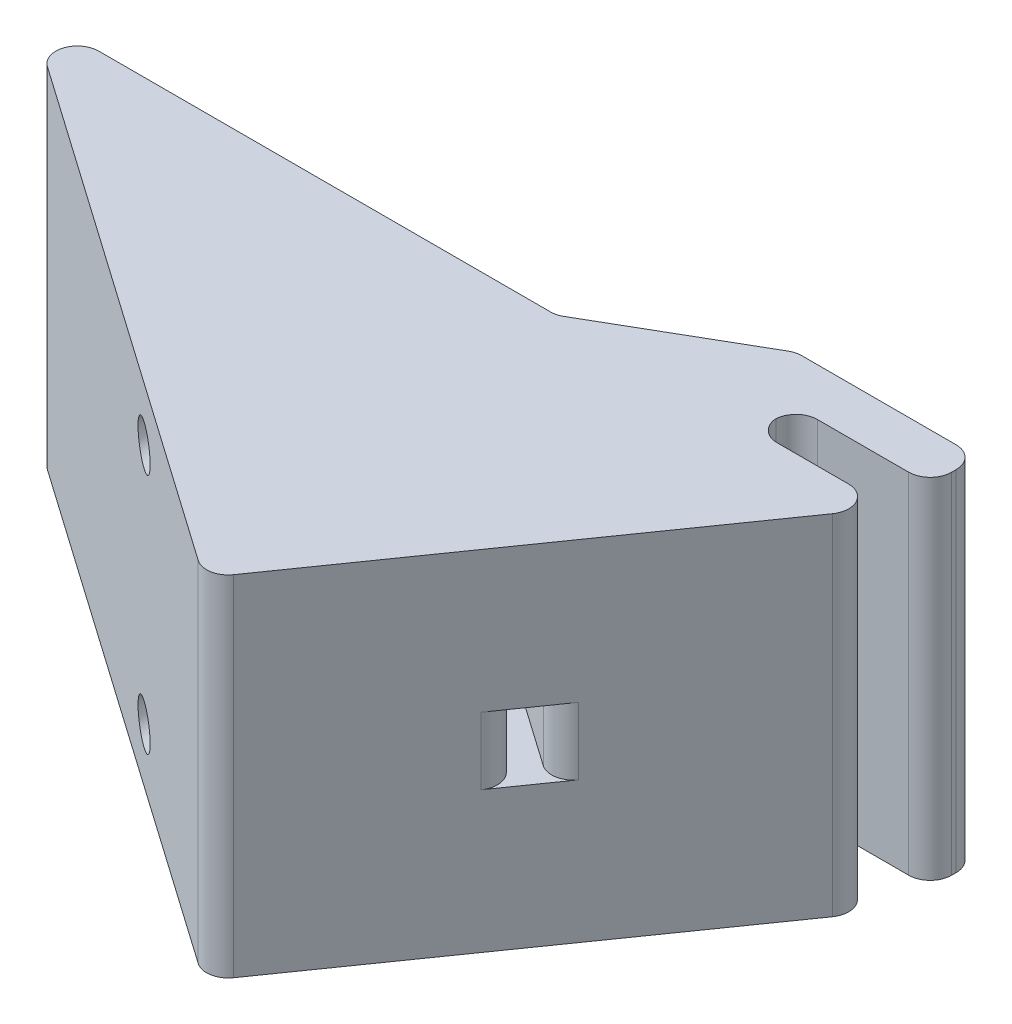
ISO-10303-21;
HEADER;
FILE_DESCRIPTION(('STEP AP214'),'2;1');
FILE_NAME('part.step','',(''),(''),'','','');
FILE_SCHEMA(('AUTOMOTIVE_DESIGN { 1 0 10303 214 1 1 1 1 }'));
ENDSEC;
DATA;
#1=APPLICATION_CONTEXT('core data for automotive mechanical design processes');
#2=APPLICATION_PROTOCOL_DEFINITION('international standard','automotive_design',2000,#1);
#3=PRODUCT_CONTEXT('',#1,'mechanical');
#4=PRODUCT('Part','Part','',(#3));
#5=PRODUCT_RELATED_PRODUCT_CATEGORY('part','',(#4));
#6=PRODUCT_DEFINITION_FORMATION('','',#4);
#7=PRODUCT_DEFINITION_CONTEXT('part definition',#1,'design');
#8=PRODUCT_DEFINITION('design','',#6,#7);
#9=PRODUCT_DEFINITION_SHAPE('','',#8);
#10=(LENGTH_UNIT() NAMED_UNIT(*) SI_UNIT(.MILLI.,.METRE.));
#11=(NAMED_UNIT(*) PLANE_ANGLE_UNIT() SI_UNIT($,.RADIAN.));
#12=(NAMED_UNIT(*) SI_UNIT($,.STERADIAN.) SOLID_ANGLE_UNIT());
#13=UNCERTAINTY_MEASURE_WITH_UNIT(LENGTH_MEASURE(1.E-05),#10,'distance_accuracy_value','');
#14=(GEOMETRIC_REPRESENTATION_CONTEXT(3) GLOBAL_UNCERTAINTY_ASSIGNED_CONTEXT((#13)) GLOBAL_UNIT_ASSIGNED_CONTEXT((#10,
#11,#12)) REPRESENTATION_CONTEXT('',''));
#15=CARTESIAN_POINT('',(0.,0.,0.));
#16=DIRECTION('',(0.,0.,1.));
#17=DIRECTION('',(1.,0.,0.));
#18=AXIS2_PLACEMENT_3D('',#15,#16,#17);
#19=CARTESIAN_POINT('',(0.,20.6375,0.));
#20=DIRECTION('',(0.,0.,1.));
#21=DIRECTION('',(1.,0.,0.));
#22=AXIS2_PLACEMENT_3D('',#19,#20,#21);
#23=PLANE('',#22);
#24=DIRECTION('',(-1.,0.,0.));
#25=VECTOR('',#24,1.);
#26=CARTESIAN_POINT('',(0.,20.6375,0.));
#27=LINE('',#26,#25);
#28=CARTESIAN_POINT('',(-4.87929460250673,20.6375,0.));
#29=VERTEX_POINT('',#28);
#30=CARTESIAN_POINT('',(-13.335,20.6375,0.));
#31=VERTEX_POINT('',#30);
#32=EDGE_CURVE('E404',#29,#31,#27,.T.);
#33=ORIENTED_EDGE('',*,*,#32,.F.);
#34=DIRECTION('',(0.,-1.,0.));
#35=VECTOR('',#34,1.);
#36=CARTESIAN_POINT('',(-4.87929460250673,20.6375,0.));
#37=LINE('',#36,#35);
#38=CARTESIAN_POINT('',(-4.87929460250673,-20.6375,0.));
#39=VERTEX_POINT('',#38);
#40=EDGE_CURVE('E295',#29,#39,#37,.T.);
#41=ORIENTED_EDGE('',*,*,#40,.T.);
#42=DIRECTION('',(-1.,0.,0.));
#43=VECTOR('',#42,1.);
#44=CARTESIAN_POINT('',(0.,-20.6375,0.));
#45=LINE('',#44,#43);
#46=CARTESIAN_POINT('',(-13.335,-20.6375,0.));
#47=VERTEX_POINT('',#46);
#48=EDGE_CURVE('E232',#39,#47,#45,.T.);
#49=ORIENTED_EDGE('',*,*,#48,.T.);
#50=DIRECTION('',(0.,-1.,0.));
#51=VECTOR('',#50,1.);
#52=CARTESIAN_POINT('',(-13.335,20.6375,0.));
#53=LINE('',#52,#51);
#54=EDGE_CURVE('E293',#47,#31,#53,.F.);
#55=ORIENTED_EDGE('',*,*,#54,.T.);
#56=EDGE_LOOP('',(#33,#41,#49,#55));
#57=FACE_BOUND('',#56,.T.);
#58=ADVANCED_FACE('F33',(#57),#23,.F.);
#59=CARTESIAN_POINT('',(-33.4253767190555,20.6375,47.736385135924));
#60=DIRECTION('',(-0.819152044288995,0.,-0.573576436351041));
#61=DIRECTION('',(-0.573576436351041,0.,0.819152044288995));
#62=AXIS2_PLACEMENT_3D('',#59,#60,#61);
#63=PLANE('',#62);
#64=DIRECTION('',(0.,1.,0.));
#65=VECTOR('',#64,1.);
#66=CARTESIAN_POINT('',(-19.9014726057149,20.6375,28.4222484330848));
#67=LINE('',#66,#65);
#68=CARTESIAN_POINT('',(-19.9014726057149,-3.96875,28.4222484330848));
#69=VERTEX_POINT('',#68);
#70=CARTESIAN_POINT('',(-19.9014726057149,3.96875,28.4222484330848));
#71=VERTEX_POINT('',#70);
#72=EDGE_CURVE('E251',#69,#71,#67,.T.);
#73=ORIENTED_EDGE('',*,*,#72,.T.);
#74=DIRECTION('',(0.573576436351041,0.,-0.819152044288995));
#75=VECTOR('',#74,1.);
#76=CARTESIAN_POINT('',(-18.4445884573832,3.96875,26.3416022405908));
#77=LINE('',#76,#75);
#78=CARTESIAN_POINT('',(-15.166599123637,3.96875,21.6601483074792));
#79=VERTEX_POINT('',#78);
#80=EDGE_CURVE('E379',#71,#79,#77,.T.);
#81=ORIENTED_EDGE('',*,*,#80,.T.);
#82=DIRECTION('',(0.,1.,0.));
#83=VECTOR('',#82,1.);
#84=CARTESIAN_POINT('',(-15.166599123637,20.6375,21.6601483074792));
#85=LINE('',#84,#83);
#86=CARTESIAN_POINT('',(-15.166599123637,-3.96875,21.6601483074792));
#87=VERTEX_POINT('',#86);
#88=EDGE_CURVE('E248',#79,#87,#85,.F.);
#89=ORIENTED_EDGE('',*,*,#88,.T.);
#90=DIRECTION('',(0.573576436351041,0.,-0.819152044288995));
#91=VECTOR('',#90,1.);
#92=CARTESIAN_POINT('',(-18.4445884573832,-3.96875,26.3416022405908));
#93=LINE('',#92,#91);
#94=EDGE_CURVE('E370',#69,#87,#93,.T.);
#95=ORIENTED_EDGE('',*,*,#94,.F.);
#96=EDGE_LOOP('',(#73,#81,#89,#95));
#97=FACE_BOUND('',#96,.T.);
#98=DIRECTION('',(0.573576436351041,0.,-0.819152044288995));
#99=VECTOR('',#98,1.);
#100=CARTESIAN_POINT('',(-33.4253767190555,20.6375,47.736385135924));
#101=LINE('',#100,#99);
#102=CARTESIAN_POINT('',(-31.9684925707238,20.6375,45.6557389434299));
#103=VERTEX_POINT('',#102);
#104=CARTESIAN_POINT('',(-2.79864841001268,20.6375,3.99688414833164));
#105=VERTEX_POINT('',#104);
#106=EDGE_CURVE('E221',#103,#105,#101,.T.);
#107=ORIENTED_EDGE('',*,*,#106,.F.);
#108=DIRECTION('',(0.,-1.,0.));
#109=VECTOR('',#108,1.);
#110=CARTESIAN_POINT('',(-31.9684925707238,20.6375,45.6557389434299));
#111=LINE('',#110,#109);
#112=CARTESIAN_POINT('',(-31.9684925707238,-20.6375,45.6557389434299));
#113=VERTEX_POINT('',#112);
#114=EDGE_CURVE('E206',#103,#113,#111,.T.);
#115=ORIENTED_EDGE('',*,*,#114,.T.);
#116=DIRECTION('',(0.573576436351041,0.,-0.819152044288995));
#117=VECTOR('',#116,1.);
#118=CARTESIAN_POINT('',(-33.4253767190555,-20.6375,47.736385135924));
#119=LINE('',#118,#117);
#120=CARTESIAN_POINT('',(-2.79864841001268,-20.6375,3.99688414833164));
#121=VERTEX_POINT('',#120);
#122=EDGE_CURVE('E218',#113,#121,#119,.T.);
#123=ORIENTED_EDGE('',*,*,#122,.T.);
#124=DIRECTION('',(0.,-1.,0.));
#125=VECTOR('',#124,1.);
#126=CARTESIAN_POINT('',(-2.79864841001268,20.6375,3.99688414833164));
#127=LINE('',#126,#125);
#128=EDGE_CURVE('E223',#121,#105,#127,.F.);
#129=ORIENTED_EDGE('',*,*,#128,.T.);
#130=EDGE_LOOP('',(#107,#115,#123,#129));
#131=FACE_BOUND('',#130,.T.);
#132=ADVANCED_FACE('F217',(#97,#131),#63,.F.);
#133=CARTESIAN_POINT('',(-56.8651541154297,14.2875,0.));
#134=DIRECTION('',(0.,0.,-1.));
#135=DIRECTION('',(1.,0.,0.));
#136=AXIS2_PLACEMENT_3D('',#133,#134,#135);
#137=CIRCLE('',#136,4.1275);
#138=CARTESIAN_POINT('',(-52.7376541154297,14.2875,0.));
#139=VERTEX_POINT('',#138);
#140=EDGE_CURVE('E492',#139,#139,#137,.T.);
#141=ORIENTED_EDGE('',*,*,#140,.F.);
#142=EDGE_LOOP('',(#141));
#143=FACE_BOUND('',#142,.T.);
#144=CARTESIAN_POINT('',(-56.8651541154297,-14.2875,0.));
#145=DIRECTION('',(0.,0.,1.));
#146=DIRECTION('',(1.,0.,0.));
#147=AXIS2_PLACEMENT_3D('',#144,#145,#146);
#148=CIRCLE('',#147,4.1275);
#149=CARTESIAN_POINT('',(-52.7376541154297,-14.2875,0.));
#150=VERTEX_POINT('',#149);
#151=EDGE_CURVE('E359',#150,#150,#148,.T.);
#152=ORIENTED_EDGE('',*,*,#151,.T.);
#153=EDGE_LOOP('',(#152));
#154=FACE_BOUND('',#153,.T.);
#155=DIRECTION('',(1.,0.,0.));
#156=VECTOR('',#155,1.);
#157=CARTESIAN_POINT('',(0.,3.96875,0.));
#158=LINE('',#157,#156);
#159=CARTESIAN_POINT('',(-56.8651541154297,3.96875,0.));
#160=VERTEX_POINT('',#159);
#161=CARTESIAN_POINT('',(-42.4730008175774,3.96875,0.));
#162=VERTEX_POINT('',#161);
#163=EDGE_CURVE('E244',#160,#162,#158,.T.);
#164=ORIENTED_EDGE('',*,*,#163,.F.);
#165=DIRECTION('',(0.,1.,0.));
#166=VECTOR('',#165,1.);
#167=CARTESIAN_POINT('',(-56.8651541154297,20.6375,0.));
#168=LINE('',#167,#166);
#169=CARTESIAN_POINT('',(-56.8651541154297,-3.96875,0.));
#170=VERTEX_POINT('',#169);
#171=EDGE_CURVE('E280',#160,#170,#168,.F.);
#172=ORIENTED_EDGE('',*,*,#171,.T.);
#173=DIRECTION('',(1.,0.,0.));
#174=VECTOR('',#173,1.);
#175=CARTESIAN_POINT('',(0.,-3.96875,0.));
#176=LINE('',#175,#174);
#177=CARTESIAN_POINT('',(-42.4730008175774,-3.96875,0.));
#178=VERTEX_POINT('',#177);
#179=EDGE_CURVE('E246',#170,#178,#176,.T.);
#180=ORIENTED_EDGE('',*,*,#179,.T.);
#181=DIRECTION('',(0.,1.,0.));
#182=VECTOR('',#181,1.);
#183=CARTESIAN_POINT('',(-42.4730008175774,20.6375,0.));
#184=LINE('',#183,#182);
#185=EDGE_CURVE('E277',#178,#162,#184,.T.);
#186=ORIENTED_EDGE('',*,*,#185,.T.);
#187=EDGE_LOOP('',(#164,#172,#180,#186));
#188=FACE_BOUND('',#187,.T.);
#189=CARTESIAN_POINT('',(-40.138555412161,-20.6375,0.));
#190=VERTEX_POINT('',#189);
#191=CARTESIAN_POINT('',(-93.5441492019974,-20.6375,0.));
#192=VERTEX_POINT('',#191);
#193=EDGE_CURVE('E228',#190,#192,#45,.T.);
#194=ORIENTED_EDGE('',*,*,#193,.T.);
#195=DIRECTION('',(0.,-1.,0.));
#196=VECTOR('',#195,1.);
#197=CARTESIAN_POINT('',(-93.5441492019974,20.6375,0.));
#198=LINE('',#197,#196);
#199=CARTESIAN_POINT('',(-93.5441492019974,20.6375,0.));
#200=VERTEX_POINT('',#199);
#201=EDGE_CURVE('E286',#192,#200,#198,.F.);
#202=ORIENTED_EDGE('',*,*,#201,.T.);
#203=CARTESIAN_POINT('',(-40.138555412161,20.6375,0.));
#204=VERTEX_POINT('',#203);
#205=EDGE_CURVE('E402',#204,#200,#27,.T.);
#206=ORIENTED_EDGE('',*,*,#205,.F.);
#207=DIRECTION('',(0.,-1.,0.));
#208=VECTOR('',#207,1.);
#209=CARTESIAN_POINT('',(-40.138555412161,-20.6375,0.));
#210=LINE('',#209,#208);
#211=EDGE_CURVE('E283',#204,#190,#210,.T.);
#212=ORIENTED_EDGE('',*,*,#211,.T.);
#213=EDGE_LOOP('',(#194,#202,#206,#212));
#214=FACE_BOUND('',#213,.T.);
#215=ADVANCED_FACE('F419',(#143,#154,#188,#214),#23,.F.);
#216=CARTESIAN_POINT('',(-101.6,20.6375,0.));
#217=DIRECTION('',(0.573576436351041,0.,-0.819152044288995));
#218=DIRECTION('',(-0.819152044288995,0.,-0.573576436351041));
#219=AXIS2_PLACEMENT_3D('',#216,#217,#218);
#220=PLANE('',#219);
#221=CARTESIAN_POINT('',(-56.8651541154297,14.2875,31.3236763090254));
#222=DIRECTION('',(0.573576436351041,0.,-0.819152044288995));
#223=DIRECTION('',(0.819152044288995,0.,0.573576436351041));
#224=AXIS2_PLACEMENT_3D('',#221,#222,#223);
#225=ELLIPSE('',#224,2.90696948948821,2.38125);
#226=CARTESIAN_POINT('',(-54.4839041154297,14.2875,32.9910455093872));
#227=VERTEX_POINT('',#226);
#228=EDGE_CURVE('E37',#227,#227,#225,.T.);
#229=ORIENTED_EDGE('',*,*,#228,.T.);
#230=EDGE_LOOP('',(#229));
#231=FACE_BOUND('',#230,.T.);
#232=CARTESIAN_POINT('',(-56.8651541154297,-14.2875,31.3236763090254));
#233=DIRECTION('',(0.573576436351041,0.,-0.819152044288995));
#234=DIRECTION('',(0.819152044288995,0.,0.573576436351041));
#235=AXIS2_PLACEMENT_3D('',#232,#233,#234);
#236=ELLIPSE('',#235,2.90696948948821,2.38125);
#237=CARTESIAN_POINT('',(-54.4839041154297,-14.2875,32.9910455093872));
#238=VERTEX_POINT('',#237);
#239=EDGE_CURVE('E353',#238,#238,#236,.T.);
#240=ORIENTED_EDGE('',*,*,#239,.T.);
#241=EDGE_LOOP('',(#240));
#242=FACE_BOUND('',#241,.T.);
#243=DIRECTION('',(0.819152044288995,0.,0.573576436351041));
#244=VECTOR('',#243,1.);
#245=CARTESIAN_POINT('',(-101.6,-20.6375,0.));
#246=LINE('',#245,#244);
#247=CARTESIAN_POINT('',(-95.001033350329,-20.6375,4.62064619249406));
#248=VERTEX_POINT('',#247);
#249=CARTESIAN_POINT('',(-35.5060229115495,-20.6375,46.2795009875923));
#250=VERTEX_POINT('',#249);
#251=EDGE_CURVE('E242',#248,#250,#246,.T.);
#252=ORIENTED_EDGE('',*,*,#251,.T.);
#253=DIRECTION('',(0.,-1.,0.));
#254=VECTOR('',#253,1.);
#255=CARTESIAN_POINT('',(-35.5060229115495,20.6375,46.2795009875923));
#256=LINE('',#255,#254);
#257=CARTESIAN_POINT('',(-35.5060229115495,20.6375,46.2795009875923));
#258=VERTEX_POINT('',#257);
#259=EDGE_CURVE('E207',#250,#258,#256,.F.);
#260=ORIENTED_EDGE('',*,*,#259,.T.);
#261=DIRECTION('',(0.819152044288995,0.,0.573576436351041));
#262=VECTOR('',#261,1.);
#263=CARTESIAN_POINT('',(-101.6,20.6375,0.));
#264=LINE('',#263,#262);
#265=CARTESIAN_POINT('',(-95.001033350329,20.6375,4.62064619249406));
#266=VERTEX_POINT('',#265);
#267=EDGE_CURVE('E238',#266,#258,#264,.T.);
#268=ORIENTED_EDGE('',*,*,#267,.F.);
#269=DIRECTION('',(0.,-1.,0.));
#270=VECTOR('',#269,1.);
#271=CARTESIAN_POINT('',(-95.001033350329,20.6375,4.62064619249406));
#272=LINE('',#271,#270);
#273=EDGE_CURVE('E211',#266,#248,#272,.T.);
#274=ORIENTED_EDGE('',*,*,#273,.T.);
#275=EDGE_LOOP('',(#252,#260,#268,#274));
#276=FACE_BOUND('',#275,.T.);
#277=ADVANCED_FACE('F413',(#231,#242,#276),#220,.F.);
#278=CARTESIAN_POINT('',(0.,20.6375,0.));
#279=DIRECTION('',(0.,-1.,0.));
#280=DIRECTION('',(0.,0.,-1.));
#281=AXIS2_PLACEMENT_3D('',#278,#279,#280);
#282=PLANE('',#281);
#283=ORIENTED_EDGE('',*,*,#267,.T.);
#284=CARTESIAN_POINT('',(-34.0491387632179,20.6375,44.1988547950983));
#285=DIRECTION('',(0.,-1.,0.));
#286=DIRECTION('',(0.,0.,-1.));
#287=AXIS2_PLACEMENT_3D('',#284,#285,#286);
#288=CIRCLE('',#287,2.54);
#289=EDGE_CURVE('E275',#258,#103,#288,.F.);
#290=ORIENTED_EDGE('',*,*,#289,.T.);
#291=ORIENTED_EDGE('',*,*,#106,.T.);
#292=CARTESIAN_POINT('',(-4.87929460250673,20.6375,2.54));
#293=DIRECTION('',(0.,-1.,0.));
#294=DIRECTION('',(0.,0.,-1.));
#295=AXIS2_PLACEMENT_3D('',#292,#293,#294);
#296=CIRCLE('',#295,2.54);
#297=EDGE_CURVE('E271',#105,#29,#296,.F.);
#298=ORIENTED_EDGE('',*,*,#297,.T.);
#299=ORIENTED_EDGE('',*,*,#32,.T.);
#300=CARTESIAN_POINT('',(-13.335,20.6375,-2.54));
#301=DIRECTION('',(0.,-1.,0.));
#302=DIRECTION('',(0.,0.,-1.));
#303=AXIS2_PLACEMENT_3D('',#300,#301,#302);
#304=CIRCLE('',#303,2.54);
#305=CARTESIAN_POINT('',(-15.8700342083491,20.6375,-2.38125));
#306=VERTEX_POINT('',#305);
#307=EDGE_CURVE('E50',#31,#306,#304,.T.);
#308=ORIENTED_EDGE('',*,*,#307,.T.);
#309=CARTESIAN_POINT('',(-13.335,20.6375,-2.2225));
#310=DIRECTION('',(0.,-1.,0.));
#311=DIRECTION('',(0.,0.,-1.));
#312=AXIS2_PLACEMENT_3D('',#309,#310,#311);
#313=CIRCLE('',#312,2.54);
#314=CARTESIAN_POINT('',(-13.335,20.6375,-4.7625));
#315=VERTEX_POINT('',#314);
#316=EDGE_CURVE('E328',#306,#315,#313,.T.);
#317=ORIENTED_EDGE('',*,*,#316,.T.);
#318=DIRECTION('',(1.,0.,0.));
#319=VECTOR('',#318,1.);
#320=CARTESIAN_POINT('',(0.,20.6375,-4.7625));
#321=LINE('',#320,#319);
#322=CARTESIAN_POINT('',(-2.54,20.6375,-4.7625));
#323=VERTEX_POINT('',#322);
#324=EDGE_CURVE('E386',#315,#323,#321,.T.);
#325=ORIENTED_EDGE('',*,*,#324,.T.);
#326=CARTESIAN_POINT('',(-2.54,20.6375,-7.3025));
#327=DIRECTION('',(0.,-1.,0.));
#328=DIRECTION('',(0.,0.,-1.));
#329=AXIS2_PLACEMENT_3D('',#326,#327,#328);
#330=CIRCLE('',#329,2.54);
#331=CARTESIAN_POINT('',(0.,20.6375,-7.3025));
#332=VERTEX_POINT('',#331);
#333=EDGE_CURVE('E269',#323,#332,#330,.F.);
#334=ORIENTED_EDGE('',*,*,#333,.T.);
#335=DIRECTION('',(0.,0.,-1.));
#336=VECTOR('',#335,1.);
#337=CARTESIAN_POINT('',(0.,20.6375,-10.3751600756682));
#338=LINE('',#337,#336);
#339=CARTESIAN_POINT('',(0.,20.6375,-7.83516007566823));
#340=VERTEX_POINT('',#339);
#341=EDGE_CURVE('E235',#332,#340,#338,.T.);
#342=ORIENTED_EDGE('',*,*,#341,.T.);
#343=CARTESIAN_POINT('',(-2.54,20.6375,-7.83516007566823));
#344=DIRECTION('',(0.,-1.,0.));
#345=DIRECTION('',(0.,0.,-1.));
#346=AXIS2_PLACEMENT_3D('',#343,#344,#345);
#347=CIRCLE('',#346,2.54);
#348=CARTESIAN_POINT('',(-2.54,20.6375,-10.3751600756682));
#349=VERTEX_POINT('',#348);
#350=EDGE_CURVE('E267',#340,#349,#347,.F.);
#351=ORIENTED_EDGE('',*,*,#350,.T.);
#352=DIRECTION('',(-1.,0.,0.));
#353=VECTOR('',#352,1.);
#354=CARTESIAN_POINT('',(-21.4876600756682,20.6375,-10.3751600756682));
#355=LINE('',#354,#353);
#356=CARTESIAN_POINT('',(-20.8070691268932,20.6375,-10.3751600756682));
#357=VERTEX_POINT('',#356);
#358=EDGE_CURVE('E229',#349,#357,#355,.T.);
#359=ORIENTED_EDGE('',*,*,#358,.T.);
#360=CARTESIAN_POINT('',(-20.8070691268932,20.6375,-7.83516007566823));
#361=DIRECTION('',(0.,-1.,0.));
#362=DIRECTION('',(0.,0.,-1.));
#363=AXIS2_PLACEMENT_3D('',#360,#361,#362);
#364=CIRCLE('',#363,2.54);
#365=CARTESIAN_POINT('',(-22.0770691268932,20.6375,-10.0348646012807));
#366=VERTEX_POINT('',#365);
#367=EDGE_CURVE('E265',#357,#366,#364,.F.);
#368=ORIENTED_EDGE('',*,*,#367,.T.);
#369=DIRECTION('',(-0.866025403784442,0.,0.499999999999995));
#370=VECTOR('',#369,1.);
#371=CARTESIAN_POINT('',(-39.457964463386,20.6375,0.));
#372=LINE('',#371,#370);
#373=CARTESIAN_POINT('',(-38.8685554121611,20.6375,-0.340295474387513));
#374=VERTEX_POINT('',#373);
#375=EDGE_CURVE('E383',#366,#374,#372,.T.);
#376=ORIENTED_EDGE('',*,*,#375,.T.);
#377=CARTESIAN_POINT('',(-40.138555412161,20.6375,-2.54));
#378=DIRECTION('',(0.,-1.,0.));
#379=DIRECTION('',(0.,0.,-1.));
#380=AXIS2_PLACEMENT_3D('',#377,#378,#379);
#381=CIRCLE('',#380,2.54);
#382=EDGE_CURVE('E325',#374,#204,#381,.T.);
#383=ORIENTED_EDGE('',*,*,#382,.T.);
#384=ORIENTED_EDGE('',*,*,#205,.T.);
#385=CARTESIAN_POINT('',(-93.5441492019974,20.6375,2.54000000000001));
#386=DIRECTION('',(0.,-1.,0.));
#387=DIRECTION('',(0.,0.,-1.));
#388=AXIS2_PLACEMENT_3D('',#385,#386,#387);
#389=CIRCLE('',#388,2.54);
#390=EDGE_CURVE('E273',#200,#266,#389,.F.);
#391=ORIENTED_EDGE('',*,*,#390,.T.);
#392=EDGE_LOOP('',(#283,#290,#291,#298,#299,#308,#317,#325,#334,#342,#351,#359,#368,#376,#383,
#384,#391));
#393=FACE_BOUND('',#392,.T.);
#394=ADVANCED_FACE('F410',(#393),#282,.F.);
#395=CARTESIAN_POINT('',(0.,-20.6375,0.));
#396=DIRECTION('',(0.,-1.,0.));
#397=DIRECTION('',(0.,0.,-1.));
#398=AXIS2_PLACEMENT_3D('',#395,#396,#397);
#399=PLANE('',#398);
#400=ORIENTED_EDGE('',*,*,#122,.F.);
#401=CARTESIAN_POINT('',(-34.0491387632179,-20.6375,44.1988547950983));
#402=DIRECTION('',(0.,-1.,0.));
#403=DIRECTION('',(0.,0.,-1.));
#404=AXIS2_PLACEMENT_3D('',#401,#402,#403);
#405=CIRCLE('',#404,2.54);
#406=EDGE_CURVE('E202',#113,#250,#405,.T.);
#407=ORIENTED_EDGE('',*,*,#406,.T.);
#408=ORIENTED_EDGE('',*,*,#251,.F.);
#409=CARTESIAN_POINT('',(-93.5441492019974,-20.6375,2.54000000000001));
#410=DIRECTION('',(0.,-1.,0.));
#411=DIRECTION('',(0.,0.,-1.));
#412=AXIS2_PLACEMENT_3D('',#409,#410,#411);
#413=CIRCLE('',#412,2.54);
#414=EDGE_CURVE('E212',#248,#192,#413,.T.);
#415=ORIENTED_EDGE('',*,*,#414,.T.);
#416=ORIENTED_EDGE('',*,*,#193,.F.);
#417=CARTESIAN_POINT('',(-40.138555412161,-20.6375,-2.54));
#418=DIRECTION('',(0.,-1.,0.));
#419=DIRECTION('',(0.,0.,-1.));
#420=AXIS2_PLACEMENT_3D('',#417,#418,#419);
#421=CIRCLE('',#420,2.54);
#422=CARTESIAN_POINT('',(-38.8685554121611,-20.6375,-0.340295474387513));
#423=VERTEX_POINT('',#422);
#424=EDGE_CURVE('E323',#190,#423,#421,.F.);
#425=ORIENTED_EDGE('',*,*,#424,.T.);
#426=DIRECTION('',(-0.866025403784442,0.,0.499999999999995));
#427=VECTOR('',#426,1.);
#428=CARTESIAN_POINT('',(-39.457964463386,-20.6375,0.));
#429=LINE('',#428,#427);
#430=CARTESIAN_POINT('',(-22.0770691268932,-20.6375,-10.0348646012807));
#431=VERTEX_POINT('',#430);
#432=EDGE_CURVE('E376',#431,#423,#429,.T.);
#433=ORIENTED_EDGE('',*,*,#432,.F.);
#434=CARTESIAN_POINT('',(-20.8070691268932,-20.6375,-7.83516007566823));
#435=DIRECTION('',(0.,-1.,0.));
#436=DIRECTION('',(0.,0.,-1.));
#437=AXIS2_PLACEMENT_3D('',#434,#435,#436);
#438=CIRCLE('',#437,2.54);
#439=CARTESIAN_POINT('',(-20.8070691268932,-20.6375,-10.3751600756682));
#440=VERTEX_POINT('',#439);
#441=EDGE_CURVE('E222',#431,#440,#438,.T.);
#442=ORIENTED_EDGE('',*,*,#441,.T.);
#443=DIRECTION('',(-1.,0.,0.));
#444=VECTOR('',#443,1.);
#445=CARTESIAN_POINT('',(-21.4876600756682,-20.6375,-10.3751600756682));
#446=LINE('',#445,#444);
#447=CARTESIAN_POINT('',(-2.54,-20.6375,-10.3751600756682));
#448=VERTEX_POINT('',#447);
#449=EDGE_CURVE('E387',#448,#440,#446,.T.);
#450=ORIENTED_EDGE('',*,*,#449,.F.);
#451=CARTESIAN_POINT('',(-2.54,-20.6375,-7.83516007566823));
#452=DIRECTION('',(0.,-1.,0.));
#453=DIRECTION('',(0.,0.,-1.));
#454=AXIS2_PLACEMENT_3D('',#451,#452,#453);
#455=CIRCLE('',#454,2.54);
#456=CARTESIAN_POINT('',(0.,-20.6375,-7.83516007566823));
#457=VERTEX_POINT('',#456);
#458=EDGE_CURVE('E256',#448,#457,#455,.T.);
#459=ORIENTED_EDGE('',*,*,#458,.T.);
#460=DIRECTION('',(0.,0.,-1.));
#461=VECTOR('',#460,1.);
#462=CARTESIAN_POINT('',(0.,-20.6375,-10.3751600756682));
#463=LINE('',#462,#461);
#464=CARTESIAN_POINT('',(0.,-20.6375,-7.3025));
#465=VERTEX_POINT('',#464);
#466=EDGE_CURVE('E397',#465,#457,#463,.T.);
#467=ORIENTED_EDGE('',*,*,#466,.F.);
#468=CARTESIAN_POINT('',(-2.54,-20.6375,-7.3025));
#469=DIRECTION('',(0.,-1.,0.));
#470=DIRECTION('',(0.,0.,-1.));
#471=AXIS2_PLACEMENT_3D('',#468,#469,#470);
#472=CIRCLE('',#471,2.54);
#473=CARTESIAN_POINT('',(-2.54,-20.6375,-4.7625));
#474=VERTEX_POINT('',#473);
#475=EDGE_CURVE('E258',#465,#474,#472,.T.);
#476=ORIENTED_EDGE('',*,*,#475,.T.);
#477=DIRECTION('',(1.,0.,0.));
#478=VECTOR('',#477,1.);
#479=CARTESIAN_POINT('',(0.,-20.6375,-4.7625));
#480=LINE('',#479,#478);
#481=CARTESIAN_POINT('',(-13.335,-20.6375,-4.7625));
#482=VERTEX_POINT('',#481);
#483=EDGE_CURVE('E394',#482,#474,#480,.T.);
#484=ORIENTED_EDGE('',*,*,#483,.F.);
#485=CARTESIAN_POINT('',(-13.335,-20.6375,-2.2225));
#486=DIRECTION('',(0.,-1.,0.));
#487=DIRECTION('',(0.,0.,-1.));
#488=AXIS2_PLACEMENT_3D('',#485,#486,#487);
#489=CIRCLE('',#488,2.54);
#490=CARTESIAN_POINT('',(-15.8700342083491,-20.6375,-2.38125));
#491=VERTEX_POINT('',#490);
#492=EDGE_CURVE('E58',#482,#491,#489,.F.);
#493=ORIENTED_EDGE('',*,*,#492,.T.);
#494=CARTESIAN_POINT('',(-13.335,-20.6375,-2.54));
#495=DIRECTION('',(0.,-1.,0.));
#496=DIRECTION('',(0.,0.,-1.));
#497=AXIS2_PLACEMENT_3D('',#494,#495,#496);
#498=CIRCLE('',#497,2.54);
#499=EDGE_CURVE('E330',#491,#47,#498,.F.);
#500=ORIENTED_EDGE('',*,*,#499,.T.);
#501=ORIENTED_EDGE('',*,*,#48,.F.);
#502=CARTESIAN_POINT('',(-4.87929460250673,-20.6375,2.54));
#503=DIRECTION('',(0.,-1.,0.));
#504=DIRECTION('',(0.,0.,-1.));
#505=AXIS2_PLACEMENT_3D('',#502,#503,#504);
#506=CIRCLE('',#505,2.54);
#507=EDGE_CURVE('E227',#39,#121,#506,.T.);
#508=ORIENTED_EDGE('',*,*,#507,.T.);
#509=EDGE_LOOP('',(#400,#407,#408,#415,#416,#425,#433,#442,#450,#459,#467,#476,#484,#493,#500,
#501,#508));
#510=FACE_BOUND('',#509,.T.);
#511=ADVANCED_FACE('F225',(#510),#399,.T.);
#512=CARTESIAN_POINT('',(-39.457964463386,20.6375,0.));
#513=DIRECTION('',(0.499999999999995,0.,0.866025403784442));
#514=DIRECTION('',(0.866025403784442,0.,-0.499999999999995));
#515=AXIS2_PLACEMENT_3D('',#512,#513,#514);
#516=PLANE('',#515);
#517=ORIENTED_EDGE('',*,*,#432,.T.);
#518=DIRECTION('',(0.,-1.,0.));
#519=VECTOR('',#518,1.);
#520=CARTESIAN_POINT('',(-38.8685554121611,20.6375,-0.340295474387513));
#521=LINE('',#520,#519);
#522=EDGE_CURVE('E291',#423,#374,#521,.F.);
#523=ORIENTED_EDGE('',*,*,#522,.T.);
#524=ORIENTED_EDGE('',*,*,#375,.F.);
#525=DIRECTION('',(0.,-1.,0.));
#526=VECTOR('',#525,1.);
#527=CARTESIAN_POINT('',(-22.0770691268932,20.6375,-10.0348646012807));
#528=LINE('',#527,#526);
#529=EDGE_CURVE('E288',#366,#431,#528,.T.);
#530=ORIENTED_EDGE('',*,*,#529,.T.);
#531=EDGE_LOOP('',(#517,#523,#524,#530));
#532=FACE_BOUND('',#531,.T.);
#533=ADVANCED_FACE('F427',(#532),#516,.F.);
#534=CARTESIAN_POINT('',(0.,20.6375,-4.7625));
#535=DIRECTION('',(0.,0.,-1.));
#536=DIRECTION('',(-1.,0.,0.));
#537=AXIS2_PLACEMENT_3D('',#534,#535,#536);
#538=PLANE('',#537);
#539=ORIENTED_EDGE('',*,*,#483,.T.);
#540=DIRECTION('',(0.,-1.,0.));
#541=VECTOR('',#540,1.);
#542=CARTESIAN_POINT('',(-2.54,20.6375,-4.7625));
#543=LINE('',#542,#541);
#544=EDGE_CURVE('E306',#474,#323,#543,.F.);
#545=ORIENTED_EDGE('',*,*,#544,.T.);
#546=ORIENTED_EDGE('',*,*,#324,.F.);
#547=DIRECTION('',(0.,-1.,0.));
#548=VECTOR('',#547,1.);
#549=CARTESIAN_POINT('',(-13.335,-20.6375,-4.7625));
#550=LINE('',#549,#548);
#551=EDGE_CURVE('E303',#315,#482,#550,.T.);
#552=ORIENTED_EDGE('',*,*,#551,.T.);
#553=EDGE_LOOP('',(#539,#545,#546,#552));
#554=FACE_BOUND('',#553,.T.);
#555=ADVANCED_FACE('F453',(#554),#538,.F.);
#556=CARTESIAN_POINT('',(0.,20.6375,-10.3751600756682));
#557=DIRECTION('',(-1.,0.,0.));
#558=DIRECTION('',(0.,0.,1.));
#559=AXIS2_PLACEMENT_3D('',#556,#557,#558);
#560=PLANE('',#559);
#561=ORIENTED_EDGE('',*,*,#341,.F.);
#562=DIRECTION('',(0.,-1.,0.));
#563=VECTOR('',#562,1.);
#564=CARTESIAN_POINT('',(0.,20.6375,-7.3025));
#565=LINE('',#564,#563);
#566=EDGE_CURVE('E300',#332,#465,#565,.T.);
#567=ORIENTED_EDGE('',*,*,#566,.T.);
#568=ORIENTED_EDGE('',*,*,#466,.T.);
#569=DIRECTION('',(0.,-1.,0.));
#570=VECTOR('',#569,1.);
#571=CARTESIAN_POINT('',(0.,20.6375,-7.83516007566823));
#572=LINE('',#571,#570);
#573=EDGE_CURVE('E298',#457,#340,#572,.F.);
#574=ORIENTED_EDGE('',*,*,#573,.T.);
#575=EDGE_LOOP('',(#561,#567,#568,#574));
#576=FACE_BOUND('',#575,.T.);
#577=ADVANCED_FACE('F446',(#576),#560,.F.);
#578=CARTESIAN_POINT('',(-21.4876600756682,20.6375,-10.3751600756682));
#579=DIRECTION('',(0.,0.,1.));
#580=DIRECTION('',(1.,0.,0.));
#581=AXIS2_PLACEMENT_3D('',#578,#579,#580);
#582=PLANE('',#581);
#583=ORIENTED_EDGE('',*,*,#358,.F.);
#584=DIRECTION('',(0.,-1.,0.));
#585=VECTOR('',#584,1.);
#586=CARTESIAN_POINT('',(-2.54,20.6375,-10.3751600756682));
#587=LINE('',#586,#585);
#588=EDGE_CURVE('E310',#349,#448,#587,.T.);
#589=ORIENTED_EDGE('',*,*,#588,.T.);
#590=ORIENTED_EDGE('',*,*,#449,.T.);
#591=DIRECTION('',(0.,-1.,0.));
#592=VECTOR('',#591,1.);
#593=CARTESIAN_POINT('',(-20.8070691268932,20.6375,-10.3751600756682));
#594=LINE('',#593,#592);
#595=EDGE_CURVE('E308',#440,#357,#594,.F.);
#596=ORIENTED_EDGE('',*,*,#595,.T.);
#597=EDGE_LOOP('',(#583,#589,#590,#596));
#598=FACE_BOUND('',#597,.T.);
#599=ADVANCED_FACE('F437',(#598),#582,.F.);
#600=CARTESIAN_POINT('',(-54.2431900062625,-3.96875,-2.60080774061756));
#601=DIRECTION('',(0.573576436351041,0.,-0.819152044288995));
#602=DIRECTION('',(-0.819152044288995,0.,-0.573576436351041));
#603=AXIS2_PLACEMENT_3D('',#600,#601,#602);
#604=PLANE('',#603);
#605=DIRECTION('',(-0.819152044288995,0.,-0.573576436351041));
#606=VECTOR('',#605,1.);
#607=CARTESIAN_POINT('',(-54.2431900062625,3.96875,-2.60080774061756));
#608=LINE('',#607,#606);
#609=CARTESIAN_POINT('',(-18.7041294644627,3.96875,22.2839103516416));
#610=VERTEX_POINT('',#609);
#611=CARTESIAN_POINT('',(-43.929884965909,3.96875,4.62064619249406));
#612=VERTEX_POINT('',#611);
#613=EDGE_CURVE('E371',#610,#612,#608,.T.);
#614=ORIENTED_EDGE('',*,*,#613,.T.);
#615=DIRECTION('',(0.,1.,0.));
#616=VECTOR('',#615,1.);
#617=CARTESIAN_POINT('',(-43.929884965909,-3.96875,4.62064619249406));
#618=LINE('',#617,#616);
#619=CARTESIAN_POINT('',(-43.929884965909,-3.96875,4.62064619249406));
#620=VERTEX_POINT('',#619);
#621=EDGE_CURVE('E321',#612,#620,#618,.F.);
#622=ORIENTED_EDGE('',*,*,#621,.T.);
#623=DIRECTION('',(-0.819152044288995,0.,-0.573576436351041));
#624=VECTOR('',#623,1.);
#625=CARTESIAN_POINT('',(-54.2431900062625,-3.96875,-2.60080774061756));
#626=LINE('',#625,#624);
#627=CARTESIAN_POINT('',(-18.7041294644627,-3.96875,22.2839103516416));
#628=VERTEX_POINT('',#627);
#629=EDGE_CURVE('E373',#628,#620,#626,.T.);
#630=ORIENTED_EDGE('',*,*,#629,.F.);
#631=DIRECTION('',(0.,1.,0.));
#632=VECTOR('',#631,1.);
#633=CARTESIAN_POINT('',(-18.7041294644627,-3.96875,22.2839103516416));
#634=LINE('',#633,#632);
#635=EDGE_CURVE('E318',#628,#610,#634,.T.);
#636=ORIENTED_EDGE('',*,*,#635,.T.);
#637=EDGE_LOOP('',(#614,#622,#630,#636));
#638=FACE_BOUND('',#637,.T.);
#639=ADVANCED_FACE('F523',(#638),#604,.F.);
#640=CARTESIAN_POINT('',(0.,-3.96875,0.));
#641=DIRECTION('',(0.,-1.,0.));
#642=DIRECTION('',(0.,0.,-1.));
#643=AXIS2_PLACEMENT_3D('',#640,#641,#642);
#644=PLANE('',#643);
#645=ORIENTED_EDGE('',*,*,#179,.F.);
#646=CARTESIAN_POINT('',(-56.8651541154297,-3.96875,2.54000000000001));
#647=DIRECTION('',(0.,-1.,0.));
#648=DIRECTION('',(0.,0.,-1.));
#649=AXIS2_PLACEMENT_3D('',#646,#647,#648);
#650=CIRCLE('',#649,2.54);
#651=CARTESIAN_POINT('',(-55.408269967098,-3.96875,0.459353807505961));
#652=VERTEX_POINT('',#651);
#653=EDGE_CURVE('E336',#170,#652,#650,.T.);
#654=ORIENTED_EDGE('',*,*,#653,.T.);
#655=DIRECTION('',(0.819152044288995,0.,0.573576436351041));
#656=VECTOR('',#655,1.);
#657=CARTESIAN_POINT('',(-56.0642951916771,-3.96875,0.));
#658=LINE('',#657,#656);
#659=CARTESIAN_POINT('',(-20.5252346498773,-3.96875,24.8847180922592));
#660=VERTEX_POINT('',#659);
#661=EDGE_CURVE('E367',#652,#660,#658,.T.);
#662=ORIENTED_EDGE('',*,*,#661,.T.);
#663=CARTESIAN_POINT('',(-21.9821187982089,-3.96875,26.9653642847532));
#664=DIRECTION('',(0.,-1.,0.));
#665=DIRECTION('',(0.,0.,-1.));
#666=AXIS2_PLACEMENT_3D('',#663,#664,#665);
#667=CIRCLE('',#666,2.54);
#668=EDGE_CURVE('E345',#660,#69,#667,.T.);
#669=ORIENTED_EDGE('',*,*,#668,.T.);
#670=ORIENTED_EDGE('',*,*,#94,.T.);
#671=CARTESIAN_POINT('',(-17.2472453161311,-3.96875,20.2032641591476));
#672=DIRECTION('',(0.,-1.,0.));
#673=DIRECTION('',(0.,0.,-1.));
#674=AXIS2_PLACEMENT_3D('',#671,#672,#673);
#675=CIRCLE('',#674,2.54);
#676=EDGE_CURVE('E11',#87,#628,#675,.T.);
#677=ORIENTED_EDGE('',*,*,#676,.T.);
#678=ORIENTED_EDGE('',*,*,#629,.T.);
#679=CARTESIAN_POINT('',(-42.4730008175774,-3.96875,2.54000000000001));
#680=DIRECTION('',(0.,-1.,0.));
#681=DIRECTION('',(0.,0.,-1.));
#682=AXIS2_PLACEMENT_3D('',#679,#680,#681);
#683=CIRCLE('',#682,2.54);
#684=EDGE_CURVE('E340',#620,#178,#683,.T.);
#685=ORIENTED_EDGE('',*,*,#684,.T.);
#686=EDGE_LOOP('',(#645,#654,#662,#669,#670,#677,#678,#685));
#687=FACE_BOUND('',#686,.T.);
#688=ADVANCED_FACE('F507',(#687),#644,.F.);
#689=CARTESIAN_POINT('',(0.,3.96875,0.));
#690=DIRECTION('',(0.,-1.,0.));
#691=DIRECTION('',(0.,0.,-1.));
#692=AXIS2_PLACEMENT_3D('',#689,#690,#691);
#693=PLANE('',#692);
#694=ORIENTED_EDGE('',*,*,#163,.T.);
#695=CARTESIAN_POINT('',(-42.4730008175774,3.96875,2.54000000000001));
#696=DIRECTION('',(0.,-1.,0.));
#697=DIRECTION('',(0.,0.,-1.));
#698=AXIS2_PLACEMENT_3D('',#695,#696,#697);
#699=CIRCLE('',#698,2.54);
#700=EDGE_CURVE('E338',#162,#612,#699,.F.);
#701=ORIENTED_EDGE('',*,*,#700,.T.);
#702=ORIENTED_EDGE('',*,*,#613,.F.);
#703=CARTESIAN_POINT('',(-17.2472453161311,3.96875,20.2032641591476));
#704=DIRECTION('',(0.,-1.,0.));
#705=DIRECTION('',(0.,0.,-1.));
#706=AXIS2_PLACEMENT_3D('',#703,#704,#705);
#707=CIRCLE('',#706,2.54);
#708=EDGE_CURVE('E42',#610,#79,#707,.F.);
#709=ORIENTED_EDGE('',*,*,#708,.T.);
#710=ORIENTED_EDGE('',*,*,#80,.F.);
#711=CARTESIAN_POINT('',(-21.9821187982089,3.96875,26.9653642847532));
#712=DIRECTION('',(0.,-1.,0.));
#713=DIRECTION('',(0.,0.,-1.));
#714=AXIS2_PLACEMENT_3D('',#711,#712,#713);
#715=CIRCLE('',#714,2.54);
#716=CARTESIAN_POINT('',(-20.5252346498773,3.96875,24.8847180922592));
#717=VERTEX_POINT('',#716);
#718=EDGE_CURVE('E343',#71,#717,#715,.F.);
#719=ORIENTED_EDGE('',*,*,#718,.T.);
#720=DIRECTION('',(0.819152044288995,0.,0.573576436351041));
#721=VECTOR('',#720,1.);
#722=CARTESIAN_POINT('',(-56.0642951916771,3.96875,0.));
#723=LINE('',#722,#721);
#724=CARTESIAN_POINT('',(-55.408269967098,3.96875,0.459353807505961));
#725=VERTEX_POINT('',#724);
#726=EDGE_CURVE('E352',#725,#717,#723,.T.);
#727=ORIENTED_EDGE('',*,*,#726,.F.);
#728=CARTESIAN_POINT('',(-56.8651541154297,3.96875,2.54000000000001));
#729=DIRECTION('',(0.,-1.,0.));
#730=DIRECTION('',(0.,0.,-1.));
#731=AXIS2_PLACEMENT_3D('',#728,#729,#730);
#732=CIRCLE('',#731,2.54);
#733=EDGE_CURVE('E333',#725,#160,#732,.F.);
#734=ORIENTED_EDGE('',*,*,#733,.T.);
#735=EDGE_LOOP('',(#694,#701,#702,#709,#710,#719,#727,#734));
#736=FACE_BOUND('',#735,.T.);
#737=ADVANCED_FACE('F501',(#736),#693,.T.);
#738=CARTESIAN_POINT('',(-56.0642951916771,-3.96875,0.));
#739=DIRECTION('',(-0.573576436351041,0.,0.819152044288995));
#740=DIRECTION('',(0.819152044288995,0.,0.573576436351041));
#741=AXIS2_PLACEMENT_3D('',#738,#739,#740);
#742=PLANE('',#741);
#743=ORIENTED_EDGE('',*,*,#661,.F.);
#744=DIRECTION('',(0.,1.,0.));
#745=VECTOR('',#744,1.);
#746=CARTESIAN_POINT('',(-55.408269967098,-3.96875,0.459353807505961));
#747=LINE('',#746,#745);
#748=EDGE_CURVE('E315',#652,#725,#747,.T.);
#749=ORIENTED_EDGE('',*,*,#748,.T.);
#750=ORIENTED_EDGE('',*,*,#726,.T.);
#751=DIRECTION('',(0.,1.,0.));
#752=VECTOR('',#751,1.);
#753=CARTESIAN_POINT('',(-20.5252346498773,-3.96875,24.8847180922592));
#754=LINE('',#753,#752);
#755=EDGE_CURVE('E313',#717,#660,#754,.F.);
#756=ORIENTED_EDGE('',*,*,#755,.T.);
#757=EDGE_LOOP('',(#743,#749,#750,#756));
#758=FACE_BOUND('',#757,.T.);
#759=ADVANCED_FACE('F510',(#758),#742,.F.);
#760=CARTESIAN_POINT('',(-34.0491387632179,20.6375,44.1988547950983));
#761=DIRECTION('',(0.,-1.,0.));
#762=DIRECTION('',(0.,0.,-1.));
#763=AXIS2_PLACEMENT_3D('',#760,#761,#762);
#764=CYLINDRICAL_SURFACE('',#763,2.54);
#765=ORIENTED_EDGE('',*,*,#289,.F.);
#766=ORIENTED_EDGE('',*,*,#259,.F.);
#767=ORIENTED_EDGE('',*,*,#406,.F.);
#768=ORIENTED_EDGE('',*,*,#114,.F.);
#769=EDGE_LOOP('',(#765,#766,#767,#768));
#770=FACE_BOUND('',#769,.T.);
#771=ADVANCED_FACE('F205',(#770),#764,.T.);
#772=CARTESIAN_POINT('',(-93.5441492019974,20.6375,2.54000000000001));
#773=DIRECTION('',(0.,-1.,0.));
#774=DIRECTION('',(0.,0.,-1.));
#775=AXIS2_PLACEMENT_3D('',#772,#773,#774);
#776=CYLINDRICAL_SURFACE('',#775,2.54);
#777=ORIENTED_EDGE('',*,*,#390,.F.);
#778=ORIENTED_EDGE('',*,*,#201,.F.);
#779=ORIENTED_EDGE('',*,*,#414,.F.);
#780=ORIENTED_EDGE('',*,*,#273,.F.);
#781=EDGE_LOOP('',(#777,#778,#779,#780));
#782=FACE_BOUND('',#781,.T.);
#783=ADVANCED_FACE('F415',(#782),#776,.T.);
#784=CARTESIAN_POINT('',(-40.138555412161,20.6375,-2.54));
#785=DIRECTION('',(0.,1.,0.));
#786=DIRECTION('',(0.,0.,1.));
#787=AXIS2_PLACEMENT_3D('',#784,#785,#786);
#788=CYLINDRICAL_SURFACE('',#787,2.54);
#789=ORIENTED_EDGE('',*,*,#382,.F.);
#790=ORIENTED_EDGE('',*,*,#522,.F.);
#791=ORIENTED_EDGE('',*,*,#424,.F.);
#792=ORIENTED_EDGE('',*,*,#211,.F.);
#793=EDGE_LOOP('',(#789,#790,#791,#792));
#794=FACE_BOUND('',#793,.T.);
#795=ADVANCED_FACE('F423',(#794),#788,.F.);
#796=CARTESIAN_POINT('',(-4.87929460250673,20.6375,2.54));
#797=DIRECTION('',(0.,-1.,0.));
#798=DIRECTION('',(0.,0.,-1.));
#799=AXIS2_PLACEMENT_3D('',#796,#797,#798);
#800=CYLINDRICAL_SURFACE('',#799,2.54);
#801=ORIENTED_EDGE('',*,*,#297,.F.);
#802=ORIENTED_EDGE('',*,*,#128,.F.);
#803=ORIENTED_EDGE('',*,*,#507,.F.);
#804=ORIENTED_EDGE('',*,*,#40,.F.);
#805=EDGE_LOOP('',(#801,#802,#803,#804));
#806=FACE_BOUND('',#805,.T.);
#807=ADVANCED_FACE('F466',(#806),#800,.T.);
#808=CARTESIAN_POINT('',(-2.54,20.6375,-7.3025));
#809=DIRECTION('',(0.,-1.,0.));
#810=DIRECTION('',(0.,0.,-1.));
#811=AXIS2_PLACEMENT_3D('',#808,#809,#810);
#812=CYLINDRICAL_SURFACE('',#811,2.54);
#813=ORIENTED_EDGE('',*,*,#333,.F.);
#814=ORIENTED_EDGE('',*,*,#544,.F.);
#815=ORIENTED_EDGE('',*,*,#475,.F.);
#816=ORIENTED_EDGE('',*,*,#566,.F.);
#817=EDGE_LOOP('',(#813,#814,#815,#816));
#818=FACE_BOUND('',#817,.T.);
#819=ADVANCED_FACE('F450',(#818),#812,.T.);
#820=CARTESIAN_POINT('',(-2.54,20.6375,-7.83516007566823));
#821=DIRECTION('',(0.,-1.,0.));
#822=DIRECTION('',(0.,0.,-1.));
#823=AXIS2_PLACEMENT_3D('',#820,#821,#822);
#824=CYLINDRICAL_SURFACE('',#823,2.54);
#825=ORIENTED_EDGE('',*,*,#350,.F.);
#826=ORIENTED_EDGE('',*,*,#573,.F.);
#827=ORIENTED_EDGE('',*,*,#458,.F.);
#828=ORIENTED_EDGE('',*,*,#588,.F.);
#829=EDGE_LOOP('',(#825,#826,#827,#828));
#830=FACE_BOUND('',#829,.T.);
#831=ADVANCED_FACE('F441',(#830),#824,.T.);
#832=CARTESIAN_POINT('',(-20.8070691268932,20.6375,-7.83516007566823));
#833=DIRECTION('',(0.,-1.,0.));
#834=DIRECTION('',(0.,0.,-1.));
#835=AXIS2_PLACEMENT_3D('',#832,#833,#834);
#836=CYLINDRICAL_SURFACE('',#835,2.54);
#837=ORIENTED_EDGE('',*,*,#367,.F.);
#838=ORIENTED_EDGE('',*,*,#595,.F.);
#839=ORIENTED_EDGE('',*,*,#441,.F.);
#840=ORIENTED_EDGE('',*,*,#529,.F.);
#841=EDGE_LOOP('',(#837,#838,#839,#840));
#842=FACE_BOUND('',#841,.T.);
#843=ADVANCED_FACE('F432',(#842),#836,.T.);
#844=CARTESIAN_POINT('',(-13.335,20.6375,-2.54));
#845=DIRECTION('',(0.,1.,0.));
#846=DIRECTION('',(0.,0.,1.));
#847=AXIS2_PLACEMENT_3D('',#844,#845,#846);
#848=CYLINDRICAL_SURFACE('',#847,2.54);
#849=DIRECTION('',(0.,1.,0.));
#850=VECTOR('',#849,1.);
#851=CARTESIAN_POINT('',(-15.8700342083491,0.,-2.38125));
#852=LINE('',#851,#850);
#853=EDGE_CURVE('E350',#306,#491,#852,.F.);
#854=ORIENTED_EDGE('',*,*,#853,.F.);
#855=ORIENTED_EDGE('',*,*,#307,.F.);
#856=ORIENTED_EDGE('',*,*,#54,.F.);
#857=ORIENTED_EDGE('',*,*,#499,.F.);
#858=EDGE_LOOP('',(#854,#855,#856,#857));
#859=FACE_BOUND('',#858,.T.);
#860=ADVANCED_FACE('F460',(#859),#848,.F.);
#861=CARTESIAN_POINT('',(-13.335,20.6375,-2.2225));
#862=DIRECTION('',(0.,1.,0.));
#863=DIRECTION('',(0.,0.,1.));
#864=AXIS2_PLACEMENT_3D('',#861,#862,#863);
#865=CYLINDRICAL_SURFACE('',#864,2.54);
#866=ORIENTED_EDGE('',*,*,#316,.F.);
#867=ORIENTED_EDGE('',*,*,#853,.T.);
#868=ORIENTED_EDGE('',*,*,#492,.F.);
#869=ORIENTED_EDGE('',*,*,#551,.F.);
#870=EDGE_LOOP('',(#866,#867,#868,#869));
#871=FACE_BOUND('',#870,.T.);
#872=ADVANCED_FACE('F458',(#871),#865,.F.);
#873=CARTESIAN_POINT('',(-56.8651541154297,-3.96875,2.54000000000001));
#874=DIRECTION('',(0.,1.,0.));
#875=DIRECTION('',(0.,0.,1.));
#876=AXIS2_PLACEMENT_3D('',#873,#874,#875);
#877=CYLINDRICAL_SURFACE('',#876,2.54);
#878=ORIENTED_EDGE('',*,*,#653,.F.);
#879=ORIENTED_EDGE('',*,*,#171,.F.);
#880=ORIENTED_EDGE('',*,*,#733,.F.);
#881=ORIENTED_EDGE('',*,*,#748,.F.);
#882=EDGE_LOOP('',(#878,#879,#880,#881));
#883=FACE_BOUND('',#882,.T.);
#884=ADVANCED_FACE('F504',(#883),#877,.T.);
#885=CARTESIAN_POINT('',(-42.4730008175774,20.6375,2.54000000000001));
#886=DIRECTION('',(0.,1.,0.));
#887=DIRECTION('',(0.,0.,1.));
#888=AXIS2_PLACEMENT_3D('',#885,#886,#887);
#889=CYLINDRICAL_SURFACE('',#888,2.54);
#890=ORIENTED_EDGE('',*,*,#684,.F.);
#891=ORIENTED_EDGE('',*,*,#621,.F.);
#892=ORIENTED_EDGE('',*,*,#700,.F.);
#893=ORIENTED_EDGE('',*,*,#185,.F.);
#894=EDGE_LOOP('',(#890,#891,#892,#893));
#895=FACE_BOUND('',#894,.T.);
#896=ADVANCED_FACE('F527',(#895),#889,.T.);
#897=CARTESIAN_POINT('',(-21.9821187982089,20.6375,26.9653642847532));
#898=DIRECTION('',(0.,1.,0.));
#899=DIRECTION('',(0.,0.,1.));
#900=AXIS2_PLACEMENT_3D('',#897,#898,#899);
#901=CYLINDRICAL_SURFACE('',#900,2.54);
#902=ORIENTED_EDGE('',*,*,#668,.F.);
#903=ORIENTED_EDGE('',*,*,#755,.F.);
#904=ORIENTED_EDGE('',*,*,#718,.F.);
#905=ORIENTED_EDGE('',*,*,#72,.F.);
#906=EDGE_LOOP('',(#902,#903,#904,#905));
#907=FACE_BOUND('',#906,.T.);
#908=ADVANCED_FACE('F514',(#907),#901,.T.);
#909=CARTESIAN_POINT('',(-17.2472453161311,-3.96875,20.2032641591476));
#910=DIRECTION('',(0.,1.,0.));
#911=DIRECTION('',(0.,0.,1.));
#912=AXIS2_PLACEMENT_3D('',#909,#910,#911);
#913=CYLINDRICAL_SURFACE('',#912,2.54);
#914=ORIENTED_EDGE('',*,*,#676,.F.);
#915=ORIENTED_EDGE('',*,*,#88,.F.);
#916=ORIENTED_EDGE('',*,*,#708,.F.);
#917=ORIENTED_EDGE('',*,*,#635,.F.);
#918=EDGE_LOOP('',(#914,#915,#916,#917));
#919=FACE_BOUND('',#918,.T.);
#920=ADVANCED_FACE('F35',(#919),#913,.T.);
#921=CARTESIAN_POINT('',(-56.8651541154297,-14.2875,46.7388547950983));
#922=DIRECTION('',(0.,0.,1.));
#923=DIRECTION('',(1.,0.,0.));
#924=AXIS2_PLACEMENT_3D('',#921,#922,#923);
#925=CYLINDRICAL_SURFACE('',#924,2.38125);
#926=CARTESIAN_POINT('',(-56.8651541154297,-14.2875,1.0492528559769));
#927=DIRECTION('',(0.,0.,1.));
#928=DIRECTION('',(1.,0.,0.));
#929=AXIS2_PLACEMENT_3D('',#926,#927,#928);
#930=CIRCLE('',#929,2.38125);
#931=CARTESIAN_POINT('',(-54.4839041154297,-14.2875,1.0492528559769));
#932=VERTEX_POINT('',#931);
#933=EDGE_CURVE('E355',#932,#932,#930,.T.);
#934=ORIENTED_EDGE('',*,*,#933,.F.);
#935=EDGE_LOOP('',(#934));
#936=FACE_BOUND('',#935,.T.);
#937=ORIENTED_EDGE('',*,*,#239,.F.);
#938=EDGE_LOOP('',(#937));
#939=FACE_BOUND('',#938,.T.);
#940=ADVANCED_FACE('F582',(#936,#939),#925,.F.);
#941=CARTESIAN_POINT('',(-56.8651541154297,-14.2875,1.0492528559769));
#942=DIRECTION('',(0.,0.,-1.));
#943=DIRECTION('',(-1.,0.,0.));
#944=AXIS2_PLACEMENT_3D('',#941,#942,#943);
#945=CONICAL_SURFACE('',#944,2.38125,1.02974425867665);
#946=ORIENTED_EDGE('',*,*,#151,.F.);
#947=EDGE_LOOP('',(#946));
#948=FACE_BOUND('',#947,.T.);
#949=ORIENTED_EDGE('',*,*,#933,.T.);
#950=EDGE_LOOP('',(#949));
#951=FACE_BOUND('',#950,.T.);
#952=ADVANCED_FACE('F590',(#948,#951),#945,.F.);
#953=CARTESIAN_POINT('',(-56.8651541154297,14.2875,46.7388547950983));
#954=DIRECTION('',(0.,0.,1.));
#955=DIRECTION('',(1.,0.,0.));
#956=AXIS2_PLACEMENT_3D('',#953,#954,#955);
#957=CYLINDRICAL_SURFACE('',#956,2.38125);
#958=CARTESIAN_POINT('',(-56.8651541154297,14.2875,1.0492528559769));
#959=DIRECTION('',(0.,0.,-1.));
#960=DIRECTION('',(1.,0.,0.));
#961=AXIS2_PLACEMENT_3D('',#958,#959,#960);
#962=CIRCLE('',#961,2.38125);
#963=CARTESIAN_POINT('',(-54.4839041154297,14.2875,1.0492528559769));
#964=VERTEX_POINT('',#963);
#965=EDGE_CURVE('E771',#964,#964,#962,.T.);
#966=ORIENTED_EDGE('',*,*,#965,.T.);
#967=EDGE_LOOP('',(#966));
#968=FACE_BOUND('',#967,.T.);
#969=ORIENTED_EDGE('',*,*,#228,.F.);
#970=EDGE_LOOP('',(#969));
#971=FACE_BOUND('',#970,.T.);
#972=ADVANCED_FACE('F599',(#968,#971),#957,.F.);
#973=CARTESIAN_POINT('',(-56.8651541154297,14.2875,1.0492528559769));
#974=DIRECTION('',(0.,0.,-1.));
#975=DIRECTION('',(-1.,0.,0.));
#976=AXIS2_PLACEMENT_3D('',#973,#974,#975);
#977=CONICAL_SURFACE('',#976,2.38125,1.02974425867665);
#978=ORIENTED_EDGE('',*,*,#140,.T.);
#979=EDGE_LOOP('',(#978));
#980=FACE_BOUND('',#979,.T.);
#981=ORIENTED_EDGE('',*,*,#965,.F.);
#982=EDGE_LOOP('',(#981));
#983=FACE_BOUND('',#982,.T.);
#984=ADVANCED_FACE('F623',(#980,#983),#977,.F.);
#985=CLOSED_SHELL('',(#58,#132,#215,#277,#394,#511,#533,#555,#577,#599,#639,#688,#737,#759,#771,
#783,#795,#807,#819,#831,#843,#860,#872,#884,#896,#908,#920,#940,#952,#972,#984));
#986=MANIFOLD_SOLID_BREP('B2',#985);
#987=ADVANCED_BREP_SHAPE_REPRESENTATION('',(#18,#986),#14);
#988=SHAPE_DEFINITION_REPRESENTATION(#9,#987);
ENDSEC;
END-ISO-10303-21;
